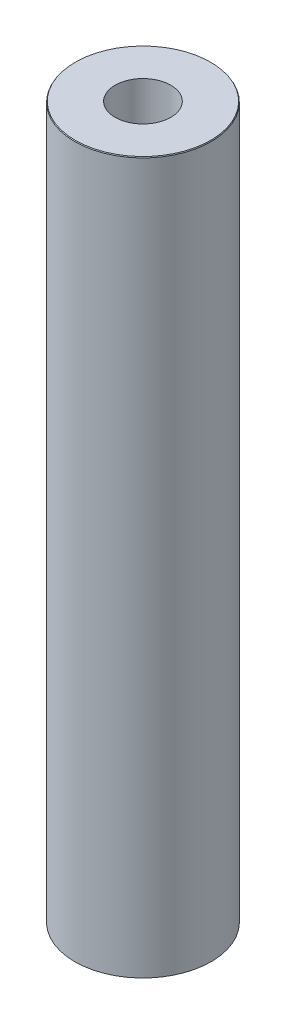
ISO-10303-21;
HEADER;
FILE_DESCRIPTION(('STEP AP214'),'2;1');
FILE_NAME('part.step','',(''),(''),'','','');
FILE_SCHEMA(('AUTOMOTIVE_DESIGN { 1 0 10303 214 1 1 1 1 }'));
ENDSEC;
DATA;
#1=APPLICATION_CONTEXT('core data for automotive mechanical design processes');
#2=APPLICATION_PROTOCOL_DEFINITION('international standard','automotive_design',2000,#1);
#3=PRODUCT_CONTEXT('',#1,'mechanical');
#4=PRODUCT('Part','Part','',(#3));
#5=PRODUCT_RELATED_PRODUCT_CATEGORY('part','',(#4));
#6=PRODUCT_DEFINITION_FORMATION('','',#4);
#7=PRODUCT_DEFINITION_CONTEXT('part definition',#1,'design');
#8=PRODUCT_DEFINITION('design','',#6,#7);
#9=PRODUCT_DEFINITION_SHAPE('','',#8);
#10=(LENGTH_UNIT() NAMED_UNIT(*) SI_UNIT(.MILLI.,.METRE.));
#11=(NAMED_UNIT(*) PLANE_ANGLE_UNIT() SI_UNIT($,.RADIAN.));
#12=(NAMED_UNIT(*) SI_UNIT($,.STERADIAN.) SOLID_ANGLE_UNIT());
#13=UNCERTAINTY_MEASURE_WITH_UNIT(LENGTH_MEASURE(1.E-05),#10,'distance_accuracy_value','');
#14=(GEOMETRIC_REPRESENTATION_CONTEXT(3) GLOBAL_UNCERTAINTY_ASSIGNED_CONTEXT((#13)) GLOBAL_UNIT_ASSIGNED_CONTEXT((#10,
#11,#12)) REPRESENTATION_CONTEXT('',''));
#15=CARTESIAN_POINT('',(0.,0.,0.));
#16=DIRECTION('',(0.,0.,1.));
#17=DIRECTION('',(1.,0.,0.));
#18=AXIS2_PLACEMENT_3D('',#15,#16,#17);
#19=CARTESIAN_POINT('',(0.,600.,0.));
#20=DIRECTION('',(0.,-1.,0.));
#21=DIRECTION('',(0.,0.,-1.));
#22=AXIS2_PLACEMENT_3D('',#19,#20,#21);
#23=CYLINDRICAL_SURFACE('',#22,57.5);
#24=CARTESIAN_POINT('',(0.,599.27253846218,0.));
#25=DIRECTION('',(0.,1.,0.));
#26=DIRECTION('',(0.,0.,1.));
#27=AXIS2_PLACEMENT_3D('',#24,#25,#26);
#28=CIRCLE('',#27,57.5);
#29=CARTESIAN_POINT('',(0.,599.27253846218,57.5));
#30=VERTEX_POINT('',#29);
#31=EDGE_CURVE('E50',#30,#30,#28,.F.);
#32=ORIENTED_EDGE('',*,*,#31,.T.);
#33=EDGE_LOOP('',(#32));
#34=FACE_BOUND('',#33,.T.);
#35=CARTESIAN_POINT('',(0.,0.420000114685237,0.));
#36=DIRECTION('',(0.,1.,0.));
#37=DIRECTION('',(0.,0.,1.));
#38=AXIS2_PLACEMENT_3D('',#35,#36,#37);
#39=CIRCLE('',#38,57.5);
#40=CARTESIAN_POINT('',(0.,0.420000114685237,57.5));
#41=VERTEX_POINT('',#40);
#42=EDGE_CURVE('E51',#41,#41,#39,.T.);
#43=ORIENTED_EDGE('',*,*,#42,.T.);
#44=EDGE_LOOP('',(#43));
#45=FACE_BOUND('',#44,.T.);
#46=ADVANCED_FACE('F39',(#34,#45),#23,.T.);
#47=CARTESIAN_POINT('',(0.,600.,0.));
#48=DIRECTION('',(0.,1.,0.));
#49=DIRECTION('',(0.,0.,1.));
#50=AXIS2_PLACEMENT_3D('',#47,#48,#49);
#51=PLANE('',#50);
#52=CARTESIAN_POINT('',(0.,600.,0.));
#53=DIRECTION('',(0.,1.,0.));
#54=DIRECTION('',(0.,0.,1.));
#55=AXIS2_PLACEMENT_3D('',#52,#53,#54);
#56=CIRCLE('',#55,57.0799998853146);
#57=CARTESIAN_POINT('',(0.,600.,57.0799998853146));
#58=VERTEX_POINT('',#57);
#59=EDGE_CURVE('E54',#58,#58,#56,.T.);
#60=ORIENTED_EDGE('',*,*,#59,.T.);
#61=EDGE_LOOP('',(#60));
#62=FACE_BOUND('',#61,.T.);
#63=CARTESIAN_POINT('',(0.,600.,0.));
#64=DIRECTION('',(0.,1.,0.));
#65=DIRECTION('',(0.,0.,1.));
#66=AXIS2_PLACEMENT_3D('',#63,#64,#65);
#67=CIRCLE('',#66,23.4898694684607);
#68=CARTESIAN_POINT('',(0.,600.,23.4898694684607));
#69=VERTEX_POINT('',#68);
#70=EDGE_CURVE('E58',#69,#69,#67,.T.);
#71=ORIENTED_EDGE('',*,*,#70,.F.);
#72=EDGE_LOOP('',(#71));
#73=FACE_BOUND('',#72,.T.);
#74=ADVANCED_FACE('F69',(#62,#73),#51,.T.);
#75=CARTESIAN_POINT('',(0.,0.,0.));
#76=DIRECTION('',(0.,1.,0.));
#77=DIRECTION('',(0.,0.,1.));
#78=AXIS2_PLACEMENT_3D('',#75,#76,#77);
#79=PLANE('',#78);
#80=CARTESIAN_POINT('',(0.,0.,0.));
#81=DIRECTION('',(0.,1.,0.));
#82=DIRECTION('',(0.,0.,1.));
#83=AXIS2_PLACEMENT_3D('',#80,#81,#82);
#84=CIRCLE('',#83,56.7725384621804);
#85=CARTESIAN_POINT('',(0.,0.,56.7725384621804));
#86=VERTEX_POINT('',#85);
#87=EDGE_CURVE('E10',#86,#86,#84,.F.);
#88=ORIENTED_EDGE('',*,*,#87,.T.);
#89=EDGE_LOOP('',(#88));
#90=FACE_BOUND('',#89,.T.);
#91=CARTESIAN_POINT('',(0.,0.,0.));
#92=DIRECTION('',(0.,1.,0.));
#93=DIRECTION('',(0.,0.,1.));
#94=AXIS2_PLACEMENT_3D('',#91,#92,#93);
#95=CIRCLE('',#94,23.4898694684607);
#96=CARTESIAN_POINT('',(0.,0.,23.4898694684607));
#97=VERTEX_POINT('',#96);
#98=EDGE_CURVE('E63',#97,#97,#95,.T.);
#99=ORIENTED_EDGE('',*,*,#98,.T.);
#100=EDGE_LOOP('',(#99));
#101=FACE_BOUND('',#100,.T.);
#102=ADVANCED_FACE('F75',(#90,#101),#79,.F.);
#103=CARTESIAN_POINT('',(0.,600.,0.));
#104=DIRECTION('',(0.,-1.,0.));
#105=DIRECTION('',(0.,0.,-1.));
#106=AXIS2_PLACEMENT_3D('',#103,#104,#105);
#107=CYLINDRICAL_SURFACE('',#106,23.4898694684607);
#108=ORIENTED_EDGE('',*,*,#70,.T.);
#109=EDGE_LOOP('',(#108));
#110=FACE_BOUND('',#109,.T.);
#111=ORIENTED_EDGE('',*,*,#98,.F.);
#112=EDGE_LOOP('',(#111));
#113=FACE_BOUND('',#112,.T.);
#114=ADVANCED_FACE('F70',(#110,#113),#107,.F.);
#115=CARTESIAN_POINT('',(0.,600.,0.));
#116=DIRECTION('',(0.,-1.,0.));
#117=DIRECTION('',(0.,0.,-1.));
#118=AXIS2_PLACEMENT_3D('',#115,#116,#117);
#119=CONICAL_SURFACE('',#118,57.0799998853146,0.523598775598309);
#120=ORIENTED_EDGE('',*,*,#31,.F.);
#121=EDGE_LOOP('',(#120));
#122=FACE_BOUND('',#121,.T.);
#123=ORIENTED_EDGE('',*,*,#59,.F.);
#124=EDGE_LOOP('',(#123));
#125=FACE_BOUND('',#124,.T.);
#126=ADVANCED_FACE('F81',(#122,#125),#119,.T.);
#127=CARTESIAN_POINT('',(0.,0.420000114685237,0.));
#128=DIRECTION('',(0.,1.,0.));
#129=DIRECTION('',(0.,0.,1.));
#130=AXIS2_PLACEMENT_3D('',#127,#128,#129);
#131=CONICAL_SURFACE('',#130,57.5,1.04719755119662);
#132=CARTESIAN_POINT('',(0.,0.,56.7725384621804));
#133=CARTESIAN_POINT('',(0.,0.00437500119463851,56.7801161865327));
#134=CARTESIAN_POINT('',(0.,0.00875000238927606,56.787693910885));
#135=CARTESIAN_POINT('',(0.,0.0175000047785512,56.8028493595895));
#136=CARTESIAN_POINT('',(0.,0.0218750059731887,56.8104270839418));
#137=CARTESIAN_POINT('',(0.,0.0306250083624648,56.8255825326464));
#138=CARTESIAN_POINT('',(0.,0.0350000095571034,56.8331602569987));
#139=CARTESIAN_POINT('',(0.,0.0437500119463795,56.8483157057033));
#140=CARTESIAN_POINT('',(0.,0.0481250131410169,56.8558934300555));
#141=CARTESIAN_POINT('',(0.,0.0568750155302923,56.8710488787601));
#142=CARTESIAN_POINT('',(0.,0.0612500167249303,56.8786266031124));
#143=CARTESIAN_POINT('',(0.,0.0700000191142062,56.893782051817));
#144=CARTESIAN_POINT('',(0.,0.0743750203088442,56.9013597761693));
#145=CARTESIAN_POINT('',(0.,0.0831250226981196,56.9165152248738));
#146=CARTESIAN_POINT('',(0.,0.0875000238927571,56.9240929492261));
#147=CARTESIAN_POINT('',(0.,0.0962500262820331,56.9392483979307));
#148=CARTESIAN_POINT('',(0.,0.100625027476672,56.946826122283));
#149=CARTESIAN_POINT('',(0.,0.109375029865948,56.9619815709876));
#150=CARTESIAN_POINT('',(0.,0.113750031060585,56.9695592953399));
#151=CARTESIAN_POINT('',(0.,0.122500033449861,56.9847147440444));
#152=CARTESIAN_POINT('',(0.,0.126875034644499,56.9922924683967));
#153=CARTESIAN_POINT('',(0.,0.135625037033775,57.0074479171013));
#154=CARTESIAN_POINT('',(0.,0.140000038228412,57.0150256414536));
#155=CARTESIAN_POINT('',(0.,0.148750040617688,57.0301810901582));
#156=CARTESIAN_POINT('',(0.,0.153125041812326,57.0377588145105));
#157=CARTESIAN_POINT('',(0.,0.161875044201602,57.052914263215));
#158=CARTESIAN_POINT('',(0.,0.166250045396239,57.0604919875673));
#159=CARTESIAN_POINT('',(0.,0.175000047785515,57.0756474362719));
#160=CARTESIAN_POINT('',(0.,0.179375048980154,57.0832251606242));
#161=CARTESIAN_POINT('',(0.,0.18812505136943,57.0983806093287));
#162=CARTESIAN_POINT('',(0.,0.192500052564067,57.105958333681));
#163=CARTESIAN_POINT('',(0.,0.201250054953343,57.1211137823856));
#164=CARTESIAN_POINT('',(0.,0.205625056147981,57.1286915067379));
#165=CARTESIAN_POINT('',(0.,0.214375058537257,57.1438469554425));
#166=CARTESIAN_POINT('',(0.,0.218750059731895,57.1514246797948));
#167=CARTESIAN_POINT('',(0.,0.22750006212117,57.1665801284993));
#168=CARTESIAN_POINT('',(0.,0.231875063315807,57.1741578528516));
#169=CARTESIAN_POINT('',(0.,0.240625065705083,57.1893133015562));
#170=CARTESIAN_POINT('',(0.,0.245000066899722,57.1968910259085));
#171=CARTESIAN_POINT('',(0.,0.253750069288998,57.2120464746131));
#172=CARTESIAN_POINT('',(0.,0.258125070483636,57.2196241989654));
#173=CARTESIAN_POINT('',(0.,0.266875072872911,57.2347796476699));
#174=CARTESIAN_POINT('',(0.,0.271250074067549,57.2423573720222));
#175=CARTESIAN_POINT('',(0.,0.280000076456825,57.2575128207268));
#176=CARTESIAN_POINT('',(0.,0.284375077651463,57.2650905450791));
#177=CARTESIAN_POINT('',(0.,0.293125080040738,57.2802459937837));
#178=CARTESIAN_POINT('',(0.,0.297500081235376,57.2878237181359));
#179=CARTESIAN_POINT('',(0.,0.306250083624652,57.3029791668405));
#180=CARTESIAN_POINT('',(0.,0.31062508481929,57.3105568911928));
#181=CARTESIAN_POINT('',(0.,0.319375087208566,57.3257123398974));
#182=CARTESIAN_POINT('',(0.,0.323750088403204,57.3332900642497));
#183=CARTESIAN_POINT('',(0.,0.332500090792479,57.3484455129542));
#184=CARTESIAN_POINT('',(0.,0.336875091987117,57.3560232373065));
#185=CARTESIAN_POINT('',(0.,0.345625094376393,57.3711786860111));
#186=CARTESIAN_POINT('',(0.,0.350000095571031,57.3787564103634));
#187=CARTESIAN_POINT('',(0.,0.358750097960307,57.393911859068));
#188=CARTESIAN_POINT('',(0.,0.363125099154945,57.4014895834203));
#189=CARTESIAN_POINT('',(0.,0.37187510154422,57.4166450321248));
#190=CARTESIAN_POINT('',(0.,0.376250102738858,57.4242227564771));
#191=CARTESIAN_POINT('',(0.,0.385000105128134,57.4393782051817));
#192=CARTESIAN_POINT('',(0.,0.389375106322772,57.446955929534));
#193=CARTESIAN_POINT('',(0.,0.398125108712048,57.4621113782386));
#194=CARTESIAN_POINT('',(0.,0.402500109906686,57.4696891025908));
#195=CARTESIAN_POINT('',(0.,0.411250112295961,57.4848445512954));
#196=CARTESIAN_POINT('',(0.,0.415625113490599,57.4924222756477));
#197=CARTESIAN_POINT('',(0.,0.420000114685237,57.5));
#198=B_SPLINE_CURVE_WITH_KNOTS('',3,(#132,#133,#134,#135,#136,#137,#138,#139,#140,#141,#142,
#143,#144,#145,#146,#147,#148,#149,#150,#151,#152,#153,#154,#155,#156,#157,#158,#159,#160,#161,
#162,#163,#164,#165,#166,#167,#168,#169,#170,#171,#172,#173,#174,#175,#176,#177,#178,#179,#180,
#181,#182,#183,#184,#185,#186,#187,#188,#189,#190,#191,#192,#193,#194,#195,#196,#197),
.UNSPECIFIED.,.F.,.F.,(4,2,2,2,2,2,2,2,2,2,2,2,2,2,2,2,2,2,2,2,2,2,2,2,2,2,2,2,2,2,2,2,4),(0.,
0.0262500071678294,0.0525000143356588,0.0787500215034822,0.105000028671312,0.131250035839141,
0.15750004300697,0.1837500501748,0.210000057342623,0.236250064510452,0.262500071678282,
0.288750078846111,0.315000086013941,0.34125009318177,0.367500100349593,0.393750107517423,
0.420000114685252,0.446250121853082,0.472500129020911,0.498750136188734,0.525000143356564,
0.551250150524393,0.577500157692223,0.603750164860052,0.630000172027875,0.656250179195705,
0.682500186363534,0.708750193531363,0.735000200699193,0.761250207867022,0.787500215034846,
0.813750222202675,0.840000229370505),.UNSPECIFIED.);
#199=EDGE_CURVE('BSEAM45',#86,#41,#198,.T.);
#200=ORIENTED_EDGE('',*,*,#87,.F.);
#201=ORIENTED_EDGE('',*,*,#42,.F.);
#202=ORIENTED_EDGE('',*,*,#199,.T.);
#203=ORIENTED_EDGE('',*,*,#199,.F.);
#204=EDGE_LOOP('',(#200,#202,#201,#203));
#205=FACE_BOUND('',#204,.T.);
#206=ADVANCED_FACE('F45',(#205),#131,.T.);
#207=CLOSED_SHELL('',(#46,#74,#102,#114,#126,#206));
#208=MANIFOLD_SOLID_BREP('B2',#207);
#209=ADVANCED_BREP_SHAPE_REPRESENTATION('',(#18,#208),#14);
#210=SHAPE_DEFINITION_REPRESENTATION(#9,#209);
ENDSEC;
END-ISO-10303-21;
